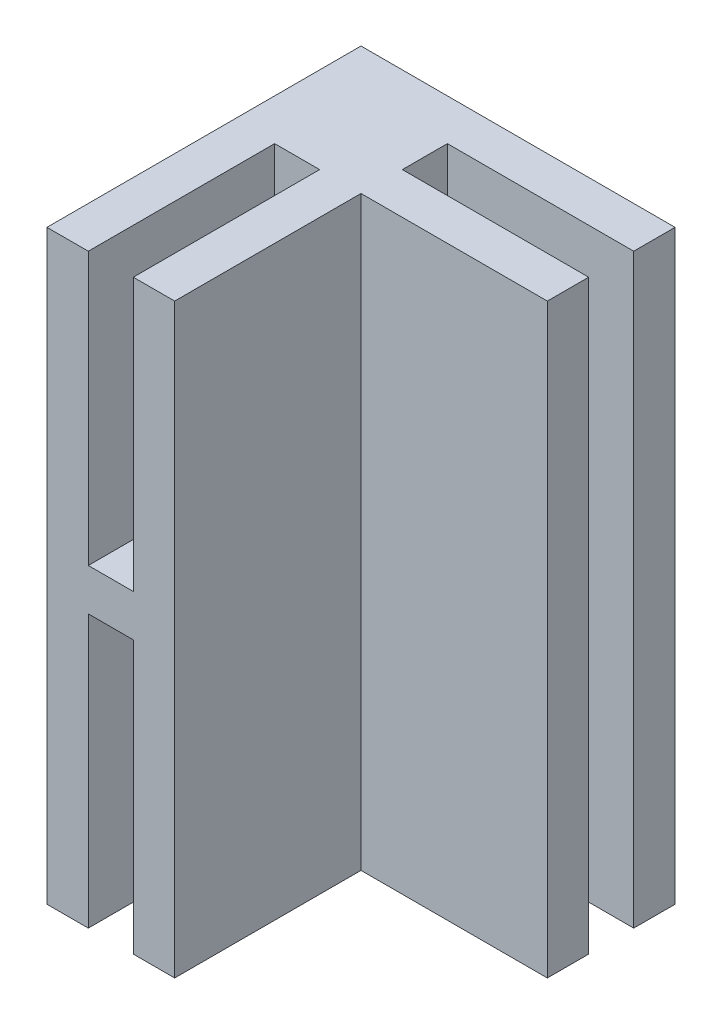
ISO-10303-21;
HEADER;
FILE_DESCRIPTION(('STEP AP214'),'2;1');
FILE_NAME('part.step','',(''),(''),'','','');
FILE_SCHEMA(('AUTOMOTIVE_DESIGN { 1 0 10303 214 1 1 1 1 }'));
ENDSEC;
DATA;
#1=APPLICATION_CONTEXT('core data for automotive mechanical design processes');
#2=APPLICATION_PROTOCOL_DEFINITION('international standard','automotive_design',2000,#1);
#3=PRODUCT_CONTEXT('',#1,'mechanical');
#4=PRODUCT('Part','Part','',(#3));
#5=PRODUCT_RELATED_PRODUCT_CATEGORY('part','',(#4));
#6=PRODUCT_DEFINITION_FORMATION('','',#4);
#7=PRODUCT_DEFINITION_CONTEXT('part definition',#1,'design');
#8=PRODUCT_DEFINITION('design','',#6,#7);
#9=PRODUCT_DEFINITION_SHAPE('','',#8);
#10=(LENGTH_UNIT() NAMED_UNIT(*) SI_UNIT(.MILLI.,.METRE.));
#11=(NAMED_UNIT(*) PLANE_ANGLE_UNIT() SI_UNIT($,.RADIAN.));
#12=(NAMED_UNIT(*) SI_UNIT($,.STERADIAN.) SOLID_ANGLE_UNIT());
#13=UNCERTAINTY_MEASURE_WITH_UNIT(LENGTH_MEASURE(1.E-05),#10,'distance_accuracy_value','');
#14=(GEOMETRIC_REPRESENTATION_CONTEXT(3) GLOBAL_UNCERTAINTY_ASSIGNED_CONTEXT((#13)) GLOBAL_UNIT_ASSIGNED_CONTEXT((#10,
#11,#12)) REPRESENTATION_CONTEXT('',''));
#15=CARTESIAN_POINT('',(0.,0.,0.));
#16=DIRECTION('',(0.,0.,1.));
#17=DIRECTION('',(1.,0.,0.));
#18=AXIS2_PLACEMENT_3D('',#15,#16,#17);
#19=CARTESIAN_POINT('',(18.6206896551724,56.,-9.38423645320196));
#20=DIRECTION('',(-1.,0.,0.));
#21=DIRECTION('',(0.,0.,1.));
#22=AXIS2_PLACEMENT_3D('',#19,#20,#21);
#23=PLANE('',#22);
#24=DIRECTION('',(0.,0.,-1.));
#25=VECTOR('',#24,1.);
#26=CARTESIAN_POINT('',(18.6206896551724,56.,-9.38423645320196));
#27=LINE('',#26,#25);
#28=CARTESIAN_POINT('',(18.6206896551724,56.,-5.43423645320196));
#29=VERTEX_POINT('',#28);
#30=CARTESIAN_POINT('',(18.6206896551724,56.,-9.38423645320196));
#31=VERTEX_POINT('',#30);
#32=EDGE_CURVE('E325',#29,#31,#27,.T.);
#33=ORIENTED_EDGE('',*,*,#32,.F.);
#34=DIRECTION('',(0.,-1.,0.));
#35=VECTOR('',#34,1.);
#36=CARTESIAN_POINT('',(18.6206896551724,56.,-5.43423645320196));
#37=LINE('',#36,#35);
#38=CARTESIAN_POINT('',(18.6206896551724,0.,-5.43423645320196));
#39=VERTEX_POINT('',#38);
#40=EDGE_CURVE('E279',#29,#39,#37,.T.);
#41=ORIENTED_EDGE('',*,*,#40,.T.);
#42=DIRECTION('',(0.,0.,-1.));
#43=VECTOR('',#42,1.);
#44=CARTESIAN_POINT('',(18.6206896551724,0.,-9.38423645320196));
#45=LINE('',#44,#43);
#46=CARTESIAN_POINT('',(18.6206896551724,0.,-9.38423645320196));
#47=VERTEX_POINT('',#46);
#48=EDGE_CURVE('E341',#39,#47,#45,.T.);
#49=ORIENTED_EDGE('',*,*,#48,.T.);
#50=DIRECTION('',(0.,-1.,0.));
#51=VECTOR('',#50,1.);
#52=CARTESIAN_POINT('',(18.6206896551724,56.,-9.38423645320196));
#53=LINE('',#52,#51);
#54=EDGE_CURVE('E48',#31,#47,#53,.T.);
#55=ORIENTED_EDGE('',*,*,#54,.F.);
#56=EDGE_LOOP('',(#33,#41,#49,#55));
#57=FACE_BOUND('',#56,.T.);
#58=ADVANCED_FACE('F39',(#57),#23,.F.);
#59=CARTESIAN_POINT('',(-11.3793103448276,56.,-9.38423645320196));
#60=DIRECTION('',(1.,0.,0.));
#61=DIRECTION('',(0.,0.,-1.));
#62=AXIS2_PLACEMENT_3D('',#59,#60,#61);
#63=PLANE('',#62);
#64=DIRECTION('',(0.,0.,1.));
#65=VECTOR('',#64,1.);
#66=CARTESIAN_POINT('',(-11.3793103448276,0.,-9.38423645320196));
#67=LINE('',#66,#65);
#68=CARTESIAN_POINT('',(-11.3793103448276,0.,-9.38423645320196));
#69=VERTEX_POINT('',#68);
#70=CARTESIAN_POINT('',(-11.3793103448276,0.,20.615763546798));
#71=VERTEX_POINT('',#70);
#72=EDGE_CURVE('E283',#69,#71,#67,.T.);
#73=ORIENTED_EDGE('',*,*,#72,.T.);
#74=DIRECTION('',(0.,-1.,0.));
#75=VECTOR('',#74,1.);
#76=CARTESIAN_POINT('',(-11.3793103448276,56.,20.615763546798));
#77=LINE('',#76,#75);
#78=CARTESIAN_POINT('',(-11.3793103448276,56.,20.615763546798));
#79=VERTEX_POINT('',#78);
#80=EDGE_CURVE('E11',#79,#71,#77,.T.);
#81=ORIENTED_EDGE('',*,*,#80,.F.);
#82=DIRECTION('',(0.,0.,1.));
#83=VECTOR('',#82,1.);
#84=CARTESIAN_POINT('',(-11.3793103448276,56.,-9.38423645320196));
#85=LINE('',#84,#83);
#86=CARTESIAN_POINT('',(-11.3793103448276,56.,-9.38423645320196));
#87=VERTEX_POINT('',#86);
#88=EDGE_CURVE('E316',#87,#79,#85,.T.);
#89=ORIENTED_EDGE('',*,*,#88,.F.);
#90=DIRECTION('',(0.,-1.,0.));
#91=VECTOR('',#90,1.);
#92=CARTESIAN_POINT('',(-11.3793103448276,56.,-9.38423645320196));
#93=LINE('',#92,#91);
#94=EDGE_CURVE('E332',#87,#69,#93,.T.);
#95=ORIENTED_EDGE('',*,*,#94,.T.);
#96=EDGE_LOOP('',(#73,#81,#89,#95));
#97=FACE_BOUND('',#96,.T.);
#98=ADVANCED_FACE('F41',(#97),#63,.F.);
#99=CARTESIAN_POINT('',(-11.3793103448276,56.,20.615763546798));
#100=DIRECTION('',(0.,0.,-1.));
#101=DIRECTION('',(-1.,0.,0.));
#102=AXIS2_PLACEMENT_3D('',#99,#100,#101);
#103=PLANE('',#102);
#104=DIRECTION('',(1.,0.,0.));
#105=VECTOR('',#104,1.);
#106=CARTESIAN_POINT('',(-7.42931034482758,30.,20.615763546798));
#107=LINE('',#106,#105);
#108=CARTESIAN_POINT('',(-7.42931034482758,30.,20.615763546798));
#109=VERTEX_POINT('',#108);
#110=CARTESIAN_POINT('',(-3.12931034482758,30.,20.615763546798));
#111=VERTEX_POINT('',#110);
#112=EDGE_CURVE('E184',#109,#111,#107,.T.);
#113=ORIENTED_EDGE('',*,*,#112,.F.);
#114=DIRECTION('',(0.,1.,0.));
#115=VECTOR('',#114,1.);
#116=CARTESIAN_POINT('',(-7.42931034482758,30.,20.615763546798));
#117=LINE('',#116,#115);
#118=CARTESIAN_POINT('',(-7.42931034482758,56.,20.615763546798));
#119=VERTEX_POINT('',#118);
#120=EDGE_CURVE('E167',#109,#119,#117,.T.);
#121=ORIENTED_EDGE('',*,*,#120,.T.);
#122=DIRECTION('',(1.,0.,0.));
#123=VECTOR('',#122,1.);
#124=CARTESIAN_POINT('',(-11.3793103448276,56.,20.615763546798));
#125=LINE('',#124,#123);
#126=EDGE_CURVE('E322',#79,#119,#125,.T.);
#127=ORIENTED_EDGE('',*,*,#126,.F.);
#128=ORIENTED_EDGE('',*,*,#80,.T.);
#129=DIRECTION('',(1.,0.,0.));
#130=VECTOR('',#129,1.);
#131=CARTESIAN_POINT('',(-11.3793103448276,0.,20.615763546798));
#132=LINE('',#131,#130);
#133=CARTESIAN_POINT('',(-7.42931034482758,0.,20.615763546798));
#134=VERTEX_POINT('',#133);
#135=EDGE_CURVE('E337',#71,#134,#132,.T.);
#136=ORIENTED_EDGE('',*,*,#135,.T.);
#137=DIRECTION('',(0.,-1.,0.));
#138=VECTOR('',#137,1.);
#139=CARTESIAN_POINT('',(-7.42931034482758,26.,20.615763546798));
#140=LINE('',#139,#138);
#141=CARTESIAN_POINT('',(-7.42931034482758,26.,20.615763546798));
#142=VERTEX_POINT('',#141);
#143=EDGE_CURVE('E63',#142,#134,#140,.T.);
#144=ORIENTED_EDGE('',*,*,#143,.F.);
#145=DIRECTION('',(-1.,0.,0.));
#146=VECTOR('',#145,1.);
#147=CARTESIAN_POINT('',(-3.12931034482758,26.,20.615763546798));
#148=LINE('',#147,#146);
#149=CARTESIAN_POINT('',(-3.12931034482758,26.,20.615763546798));
#150=VERTEX_POINT('',#149);
#151=EDGE_CURVE('E220',#150,#142,#148,.T.);
#152=ORIENTED_EDGE('',*,*,#151,.F.);
#153=DIRECTION('',(0.,-1.,0.));
#154=VECTOR('',#153,1.);
#155=CARTESIAN_POINT('',(-3.12931034482758,26.,20.615763546798));
#156=LINE('',#155,#154);
#157=CARTESIAN_POINT('',(-3.12931034482758,0.,20.615763546798));
#158=VERTEX_POINT('',#157);
#159=EDGE_CURVE('E233',#150,#158,#156,.T.);
#160=ORIENTED_EDGE('',*,*,#159,.T.);
#161=CARTESIAN_POINT('',(0.820689655172419,0.,20.615763546798));
#162=VERTEX_POINT('',#161);
#163=EDGE_CURVE('E336',#158,#162,#132,.T.);
#164=ORIENTED_EDGE('',*,*,#163,.T.);
#165=DIRECTION('',(0.,-1.,0.));
#166=VECTOR('',#165,1.);
#167=CARTESIAN_POINT('',(0.820689655172419,56.,20.615763546798));
#168=LINE('',#167,#166);
#169=CARTESIAN_POINT('',(0.820689655172419,56.,20.615763546798));
#170=VERTEX_POINT('',#169);
#171=EDGE_CURVE('E301',#170,#162,#168,.T.);
#172=ORIENTED_EDGE('',*,*,#171,.F.);
#173=CARTESIAN_POINT('',(-3.12931034482758,56.,20.615763546798));
#174=VERTEX_POINT('',#173);
#175=EDGE_CURVE('E320',#174,#170,#125,.T.);
#176=ORIENTED_EDGE('',*,*,#175,.F.);
#177=DIRECTION('',(0.,1.,0.));
#178=VECTOR('',#177,1.);
#179=CARTESIAN_POINT('',(-3.12931034482758,30.,20.615763546798));
#180=LINE('',#179,#178);
#181=EDGE_CURVE('E55',#111,#174,#180,.T.);
#182=ORIENTED_EDGE('',*,*,#181,.F.);
#183=EDGE_LOOP('',(#113,#121,#127,#128,#136,#144,#152,#160,#164,#172,#176,#182));
#184=FACE_BOUND('',#183,.T.);
#185=ADVANCED_FACE('F189',(#184),#103,.F.);
#186=CARTESIAN_POINT('',(18.6206896551724,0.,2.81576354679804));
#187=VERTEX_POINT('',#186);
#188=CARTESIAN_POINT('',(18.6206896551724,0.,-1.13423645320196));
#189=VERTEX_POINT('',#188);
#190=EDGE_CURVE('E344',#187,#189,#45,.T.);
#191=ORIENTED_EDGE('',*,*,#190,.T.);
#192=DIRECTION('',(0.,-1.,0.));
#193=VECTOR('',#192,1.);
#194=CARTESIAN_POINT('',(18.6206896551724,56.,-1.13423645320196));
#195=LINE('',#194,#193);
#196=CARTESIAN_POINT('',(18.6206896551724,56.,-1.13423645320196));
#197=VERTEX_POINT('',#196);
#198=EDGE_CURVE('E267',#197,#189,#195,.T.);
#199=ORIENTED_EDGE('',*,*,#198,.F.);
#200=CARTESIAN_POINT('',(18.6206896551724,56.,2.81576354679804));
#201=VERTEX_POINT('',#200);
#202=EDGE_CURVE('E328',#201,#197,#27,.T.);
#203=ORIENTED_EDGE('',*,*,#202,.F.);
#204=DIRECTION('',(0.,-1.,0.));
#205=VECTOR('',#204,1.);
#206=CARTESIAN_POINT('',(18.6206896551724,56.,2.81576354679804));
#207=LINE('',#206,#205);
#208=EDGE_CURVE('E273',#201,#187,#207,.T.);
#209=ORIENTED_EDGE('',*,*,#208,.T.);
#210=EDGE_LOOP('',(#191,#199,#203,#209));
#211=FACE_BOUND('',#210,.T.);
#212=ADVANCED_FACE('F386',(#211),#23,.F.);
#213=CARTESIAN_POINT('',(-11.3793103448276,56.,-9.38423645320196));
#214=DIRECTION('',(0.,0.,1.));
#215=DIRECTION('',(1.,0.,0.));
#216=AXIS2_PLACEMENT_3D('',#213,#214,#215);
#217=PLANE('',#216);
#218=DIRECTION('',(-1.,0.,0.));
#219=VECTOR('',#218,1.);
#220=CARTESIAN_POINT('',(-11.3793103448276,0.,-9.38423645320196));
#221=LINE('',#220,#219);
#222=EDGE_CURVE('E321',#47,#69,#221,.T.);
#223=ORIENTED_EDGE('',*,*,#222,.T.);
#224=ORIENTED_EDGE('',*,*,#94,.F.);
#225=DIRECTION('',(-1.,0.,0.));
#226=VECTOR('',#225,1.);
#227=CARTESIAN_POINT('',(-11.3793103448276,56.,-9.38423645320196));
#228=LINE('',#227,#226);
#229=EDGE_CURVE('E329',#31,#87,#228,.T.);
#230=ORIENTED_EDGE('',*,*,#229,.F.);
#231=ORIENTED_EDGE('',*,*,#54,.T.);
#232=EDGE_LOOP('',(#223,#224,#230,#231));
#233=FACE_BOUND('',#232,.T.);
#234=ADVANCED_FACE('F355',(#233),#217,.F.);
#235=CARTESIAN_POINT('',(0.,56.,0.));
#236=DIRECTION('',(0.,1.,0.));
#237=DIRECTION('',(0.,0.,1.));
#238=AXIS2_PLACEMENT_3D('',#235,#236,#237);
#239=PLANE('',#238);
#240=DIRECTION('',(0.,0.,1.));
#241=VECTOR('',#240,1.);
#242=CARTESIAN_POINT('',(-7.42931034482758,56.,20.615763546798));
#243=LINE('',#242,#241);
#244=CARTESIAN_POINT('',(-7.42931034482758,56.,2.81576354679803));
#245=VERTEX_POINT('',#244);
#246=EDGE_CURVE('E173',#245,#119,#243,.T.);
#247=ORIENTED_EDGE('',*,*,#246,.F.);
#248=DIRECTION('',(-1.,0.,0.));
#249=VECTOR('',#248,1.);
#250=CARTESIAN_POINT('',(-7.42931034482758,56.,2.81576354679803));
#251=LINE('',#250,#249);
#252=CARTESIAN_POINT('',(-3.12931034482758,56.,2.81576354679803));
#253=VERTEX_POINT('',#252);
#254=EDGE_CURVE('E187',#253,#245,#251,.T.);
#255=ORIENTED_EDGE('',*,*,#254,.F.);
#256=DIRECTION('',(0.,0.,-1.));
#257=VECTOR('',#256,1.);
#258=CARTESIAN_POINT('',(-3.12931034482758,56.,20.615763546798));
#259=LINE('',#258,#257);
#260=EDGE_CURVE('E201',#174,#253,#259,.T.);
#261=ORIENTED_EDGE('',*,*,#260,.F.);
#262=ORIENTED_EDGE('',*,*,#175,.T.);
#263=DIRECTION('',(0.,0.,-1.));
#264=VECTOR('',#263,1.);
#265=CARTESIAN_POINT('',(0.820689655172419,56.,20.615763546798));
#266=LINE('',#265,#264);
#267=CARTESIAN_POINT('',(0.820689655172419,56.,2.81576354679804));
#268=VERTEX_POINT('',#267);
#269=EDGE_CURVE('E292',#170,#268,#266,.T.);
#270=ORIENTED_EDGE('',*,*,#269,.T.);
#271=DIRECTION('',(1.,0.,0.));
#272=VECTOR('',#271,1.);
#273=CARTESIAN_POINT('',(18.6206896551724,56.,2.81576354679804));
#274=LINE('',#273,#272);
#275=EDGE_CURVE('E296',#268,#201,#274,.T.);
#276=ORIENTED_EDGE('',*,*,#275,.T.);
#277=ORIENTED_EDGE('',*,*,#202,.T.);
#278=DIRECTION('',(-1.,0.,0.));
#279=VECTOR('',#278,1.);
#280=CARTESIAN_POINT('',(18.6206896551724,56.,-1.13423645320196));
#281=LINE('',#280,#279);
#282=CARTESIAN_POINT('',(0.820689655172419,56.,-1.13423645320196));
#283=VERTEX_POINT('',#282);
#284=EDGE_CURVE('E254',#197,#283,#281,.T.);
#285=ORIENTED_EDGE('',*,*,#284,.T.);
#286=DIRECTION('',(0.,0.,-1.));
#287=VECTOR('',#286,1.);
#288=CARTESIAN_POINT('',(0.820689655172419,56.,-5.43423645320197));
#289=LINE('',#288,#287);
#290=CARTESIAN_POINT('',(0.820689655172419,56.,-5.43423645320197));
#291=VERTEX_POINT('',#290);
#292=EDGE_CURVE('E258',#283,#291,#289,.T.);
#293=ORIENTED_EDGE('',*,*,#292,.T.);
#294=DIRECTION('',(1.,0.,0.));
#295=VECTOR('',#294,1.);
#296=CARTESIAN_POINT('',(18.6206896551724,56.,-5.43423645320196));
#297=LINE('',#296,#295);
#298=EDGE_CURVE('E263',#291,#29,#297,.T.);
#299=ORIENTED_EDGE('',*,*,#298,.T.);
#300=ORIENTED_EDGE('',*,*,#32,.T.);
#301=ORIENTED_EDGE('',*,*,#229,.T.);
#302=ORIENTED_EDGE('',*,*,#88,.T.);
#303=ORIENTED_EDGE('',*,*,#126,.T.);
#304=EDGE_LOOP('',(#247,#255,#261,#262,#270,#276,#277,#285,#293,#299,#300,#301,#302,#303));
#305=FACE_BOUND('',#304,.T.);
#306=ADVANCED_FACE('F369',(#305),#239,.T.);
#307=CARTESIAN_POINT('',(0.,0.,0.));
#308=DIRECTION('',(0.,1.,0.));
#309=DIRECTION('',(0.,0.,1.));
#310=AXIS2_PLACEMENT_3D('',#307,#308,#309);
#311=PLANE('',#310);
#312=ORIENTED_EDGE('',*,*,#163,.F.);
#313=DIRECTION('',(0.,0.,1.));
#314=VECTOR('',#313,1.);
#315=CARTESIAN_POINT('',(-3.12931034482758,0.,20.615763546798));
#316=LINE('',#315,#314);
#317=CARTESIAN_POINT('',(-3.12931034482758,0.,2.81576354679803));
#318=VERTEX_POINT('',#317);
#319=EDGE_CURVE('E210',#318,#158,#316,.T.);
#320=ORIENTED_EDGE('',*,*,#319,.F.);
#321=DIRECTION('',(1.,0.,0.));
#322=VECTOR('',#321,1.);
#323=CARTESIAN_POINT('',(-3.12931034482758,0.,2.81576354679803));
#324=LINE('',#323,#322);
#325=CARTESIAN_POINT('',(-7.42931034482758,0.,2.81576354679803));
#326=VERTEX_POINT('',#325);
#327=EDGE_CURVE('E221',#326,#318,#324,.T.);
#328=ORIENTED_EDGE('',*,*,#327,.F.);
#329=DIRECTION('',(0.,0.,-1.));
#330=VECTOR('',#329,1.);
#331=CARTESIAN_POINT('',(-7.42931034482758,0.,20.615763546798));
#332=LINE('',#331,#330);
#333=EDGE_CURVE('E236',#134,#326,#332,.T.);
#334=ORIENTED_EDGE('',*,*,#333,.F.);
#335=ORIENTED_EDGE('',*,*,#135,.F.);
#336=ORIENTED_EDGE('',*,*,#72,.F.);
#337=ORIENTED_EDGE('',*,*,#222,.F.);
#338=ORIENTED_EDGE('',*,*,#48,.F.);
#339=DIRECTION('',(1.,0.,0.));
#340=VECTOR('',#339,1.);
#341=CARTESIAN_POINT('',(18.6206896551724,0.,-5.43423645320196));
#342=LINE('',#341,#340);
#343=CARTESIAN_POINT('',(0.820689655172419,0.,-5.43423645320197));
#344=VERTEX_POINT('',#343);
#345=EDGE_CURVE('E259',#344,#39,#342,.T.);
#346=ORIENTED_EDGE('',*,*,#345,.F.);
#347=DIRECTION('',(0.,0.,-1.));
#348=VECTOR('',#347,1.);
#349=CARTESIAN_POINT('',(0.820689655172419,0.,-5.43423645320197));
#350=LINE('',#349,#348);
#351=CARTESIAN_POINT('',(0.820689655172419,0.,-1.13423645320196));
#352=VERTEX_POINT('',#351);
#353=EDGE_CURVE('E272',#352,#344,#350,.T.);
#354=ORIENTED_EDGE('',*,*,#353,.F.);
#355=DIRECTION('',(-1.,0.,0.));
#356=VECTOR('',#355,1.);
#357=CARTESIAN_POINT('',(18.6206896551724,0.,-1.13423645320196));
#358=LINE('',#357,#356);
#359=EDGE_CURVE('E268',#189,#352,#358,.T.);
#360=ORIENTED_EDGE('',*,*,#359,.F.);
#361=ORIENTED_EDGE('',*,*,#190,.F.);
#362=DIRECTION('',(1.,0.,0.));
#363=VECTOR('',#362,1.);
#364=CARTESIAN_POINT('',(18.6206896551724,0.,2.81576354679804));
#365=LINE('',#364,#363);
#366=CARTESIAN_POINT('',(0.820689655172419,0.,2.81576354679804));
#367=VERTEX_POINT('',#366);
#368=EDGE_CURVE('E297',#367,#187,#365,.T.);
#369=ORIENTED_EDGE('',*,*,#368,.F.);
#370=DIRECTION('',(0.,0.,-1.));
#371=VECTOR('',#370,1.);
#372=CARTESIAN_POINT('',(0.820689655172419,0.,20.615763546798));
#373=LINE('',#372,#371);
#374=EDGE_CURVE('E245',#162,#367,#373,.T.);
#375=ORIENTED_EDGE('',*,*,#374,.F.);
#376=EDGE_LOOP('',(#312,#320,#328,#334,#335,#336,#337,#338,#346,#354,#360,#361,#369,#375));
#377=FACE_BOUND('',#376,.T.);
#378=ADVANCED_FACE('F363',(#377),#311,.F.);
#379=CARTESIAN_POINT('',(18.6206896551724,56.,2.81576354679804));
#380=DIRECTION('',(0.,0.,-1.));
#381=DIRECTION('',(-1.,0.,0.));
#382=AXIS2_PLACEMENT_3D('',#379,#380,#381);
#383=PLANE('',#382);
#384=ORIENTED_EDGE('',*,*,#368,.T.);
#385=ORIENTED_EDGE('',*,*,#208,.F.);
#386=ORIENTED_EDGE('',*,*,#275,.F.);
#387=DIRECTION('',(0.,-1.,0.));
#388=VECTOR('',#387,1.);
#389=CARTESIAN_POINT('',(0.820689655172419,56.,2.81576354679804));
#390=LINE('',#389,#388);
#391=EDGE_CURVE('E310',#268,#367,#390,.T.);
#392=ORIENTED_EDGE('',*,*,#391,.T.);
#393=EDGE_LOOP('',(#384,#385,#386,#392));
#394=FACE_BOUND('',#393,.T.);
#395=ADVANCED_FACE('F401',(#394),#383,.F.);
#396=CARTESIAN_POINT('',(0.820689655172419,56.,20.615763546798));
#397=DIRECTION('',(-1.,0.,0.));
#398=DIRECTION('',(0.,0.,1.));
#399=AXIS2_PLACEMENT_3D('',#396,#397,#398);
#400=PLANE('',#399);
#401=ORIENTED_EDGE('',*,*,#374,.T.);
#402=ORIENTED_EDGE('',*,*,#391,.F.);
#403=ORIENTED_EDGE('',*,*,#269,.F.);
#404=ORIENTED_EDGE('',*,*,#171,.T.);
#405=EDGE_LOOP('',(#401,#402,#403,#404));
#406=FACE_BOUND('',#405,.T.);
#407=ADVANCED_FACE('F398',(#406),#400,.F.);
#408=CARTESIAN_POINT('',(18.6206896551724,56.,-5.43423645320196));
#409=DIRECTION('',(0.,0.,-1.));
#410=DIRECTION('',(-1.,0.,0.));
#411=AXIS2_PLACEMENT_3D('',#408,#409,#410);
#412=PLANE('',#411);
#413=ORIENTED_EDGE('',*,*,#345,.T.);
#414=ORIENTED_EDGE('',*,*,#40,.F.);
#415=ORIENTED_EDGE('',*,*,#298,.F.);
#416=DIRECTION('',(0.,-1.,0.));
#417=VECTOR('',#416,1.);
#418=CARTESIAN_POINT('',(0.820689655172419,56.,-5.43423645320197));
#419=LINE('',#418,#417);
#420=EDGE_CURVE('E284',#291,#344,#419,.T.);
#421=ORIENTED_EDGE('',*,*,#420,.T.);
#422=EDGE_LOOP('',(#413,#414,#415,#421));
#423=FACE_BOUND('',#422,.T.);
#424=ADVANCED_FACE('F372',(#423),#412,.F.);
#425=CARTESIAN_POINT('',(0.820689655172419,56.,-5.43423645320197));
#426=DIRECTION('',(-1.,0.,0.));
#427=DIRECTION('',(0.,0.,1.));
#428=AXIS2_PLACEMENT_3D('',#425,#426,#427);
#429=PLANE('',#428);
#430=ORIENTED_EDGE('',*,*,#353,.T.);
#431=ORIENTED_EDGE('',*,*,#420,.F.);
#432=ORIENTED_EDGE('',*,*,#292,.F.);
#433=DIRECTION('',(0.,-1.,0.));
#434=VECTOR('',#433,1.);
#435=CARTESIAN_POINT('',(0.820689655172419,56.,-1.13423645320196));
#436=LINE('',#435,#434);
#437=EDGE_CURVE('E287',#283,#352,#436,.T.);
#438=ORIENTED_EDGE('',*,*,#437,.T.);
#439=EDGE_LOOP('',(#430,#431,#432,#438));
#440=FACE_BOUND('',#439,.T.);
#441=ADVANCED_FACE('F378',(#440),#429,.F.);
#442=CARTESIAN_POINT('',(18.6206896551724,56.,-1.13423645320196));
#443=DIRECTION('',(0.,0.,1.));
#444=DIRECTION('',(1.,0.,0.));
#445=AXIS2_PLACEMENT_3D('',#442,#443,#444);
#446=PLANE('',#445);
#447=ORIENTED_EDGE('',*,*,#359,.T.);
#448=ORIENTED_EDGE('',*,*,#437,.F.);
#449=ORIENTED_EDGE('',*,*,#284,.F.);
#450=ORIENTED_EDGE('',*,*,#198,.T.);
#451=EDGE_LOOP('',(#447,#448,#449,#450));
#452=FACE_BOUND('',#451,.T.);
#453=ADVANCED_FACE('F381',(#452),#446,.F.);
#454=CARTESIAN_POINT('',(-3.12931034482758,26.,20.615763546798));
#455=DIRECTION('',(1.,0.,0.));
#456=DIRECTION('',(0.,0.,-1.));
#457=AXIS2_PLACEMENT_3D('',#454,#455,#456);
#458=PLANE('',#457);
#459=ORIENTED_EDGE('',*,*,#319,.T.);
#460=ORIENTED_EDGE('',*,*,#159,.F.);
#461=DIRECTION('',(0.,0.,1.));
#462=VECTOR('',#461,1.);
#463=CARTESIAN_POINT('',(-3.12931034482758,26.,20.615763546798));
#464=LINE('',#463,#462);
#465=CARTESIAN_POINT('',(-3.12931034482758,26.,2.81576354679803));
#466=VERTEX_POINT('',#465);
#467=EDGE_CURVE('E216',#466,#150,#464,.T.);
#468=ORIENTED_EDGE('',*,*,#467,.F.);
#469=DIRECTION('',(0.,-1.,0.));
#470=VECTOR('',#469,1.);
#471=CARTESIAN_POINT('',(-3.12931034482758,26.,2.81576354679803));
#472=LINE('',#471,#470);
#473=EDGE_CURVE('E242',#466,#318,#472,.T.);
#474=ORIENTED_EDGE('',*,*,#473,.T.);
#475=EDGE_LOOP('',(#459,#460,#468,#474));
#476=FACE_BOUND('',#475,.T.);
#477=ADVANCED_FACE('F494',(#476),#458,.F.);
#478=CARTESIAN_POINT('',(-3.12931034482758,26.,2.81576354679803));
#479=DIRECTION('',(0.,0.,-1.));
#480=DIRECTION('',(-1.,0.,0.));
#481=AXIS2_PLACEMENT_3D('',#478,#479,#480);
#482=PLANE('',#481);
#483=ORIENTED_EDGE('',*,*,#327,.T.);
#484=ORIENTED_EDGE('',*,*,#473,.F.);
#485=DIRECTION('',(1.,0.,0.));
#486=VECTOR('',#485,1.);
#487=CARTESIAN_POINT('',(-3.12931034482758,26.,2.81576354679803));
#488=LINE('',#487,#486);
#489=CARTESIAN_POINT('',(-7.42931034482758,26.,2.81576354679803));
#490=VERTEX_POINT('',#489);
#491=EDGE_CURVE('E229',#490,#466,#488,.T.);
#492=ORIENTED_EDGE('',*,*,#491,.F.);
#493=DIRECTION('',(0.,-1.,0.));
#494=VECTOR('',#493,1.);
#495=CARTESIAN_POINT('',(-7.42931034482758,26.,2.81576354679803));
#496=LINE('',#495,#494);
#497=EDGE_CURVE('E246',#490,#326,#496,.T.);
#498=ORIENTED_EDGE('',*,*,#497,.T.);
#499=EDGE_LOOP('',(#483,#484,#492,#498));
#500=FACE_BOUND('',#499,.T.);
#501=ADVANCED_FACE('F509',(#500),#482,.F.);
#502=CARTESIAN_POINT('',(-7.42931034482758,26.,20.615763546798));
#503=DIRECTION('',(-1.,0.,0.));
#504=DIRECTION('',(0.,0.,1.));
#505=AXIS2_PLACEMENT_3D('',#502,#503,#504);
#506=PLANE('',#505);
#507=ORIENTED_EDGE('',*,*,#333,.T.);
#508=ORIENTED_EDGE('',*,*,#497,.F.);
#509=DIRECTION('',(0.,0.,-1.));
#510=VECTOR('',#509,1.);
#511=CARTESIAN_POINT('',(-7.42931034482758,26.,20.615763546798));
#512=LINE('',#511,#510);
#513=EDGE_CURVE('E225',#142,#490,#512,.T.);
#514=ORIENTED_EDGE('',*,*,#513,.F.);
#515=ORIENTED_EDGE('',*,*,#143,.T.);
#516=EDGE_LOOP('',(#507,#508,#514,#515));
#517=FACE_BOUND('',#516,.T.);
#518=ADVANCED_FACE('F519',(#517),#506,.F.);
#519=CARTESIAN_POINT('',(0.,26.,0.));
#520=DIRECTION('',(0.,1.,0.));
#521=DIRECTION('',(0.,0.,1.));
#522=AXIS2_PLACEMENT_3D('',#519,#520,#521);
#523=PLANE('',#522);
#524=ORIENTED_EDGE('',*,*,#467,.T.);
#525=ORIENTED_EDGE('',*,*,#151,.T.);
#526=ORIENTED_EDGE('',*,*,#513,.T.);
#527=ORIENTED_EDGE('',*,*,#491,.T.);
#528=EDGE_LOOP('',(#524,#525,#526,#527));
#529=FACE_BOUND('',#528,.T.);
#530=ADVANCED_FACE('F413',(#529),#523,.F.);
#531=CARTESIAN_POINT('',(-7.42931034482758,30.,20.615763546798));
#532=DIRECTION('',(-1.,0.,0.));
#533=DIRECTION('',(0.,0.,1.));
#534=AXIS2_PLACEMENT_3D('',#531,#532,#533);
#535=PLANE('',#534);
#536=ORIENTED_EDGE('',*,*,#246,.T.);
#537=ORIENTED_EDGE('',*,*,#120,.F.);
#538=DIRECTION('',(0.,0.,1.));
#539=VECTOR('',#538,1.);
#540=CARTESIAN_POINT('',(-7.42931034482758,30.,20.615763546798));
#541=LINE('',#540,#539);
#542=CARTESIAN_POINT('',(-7.42931034482758,30.,2.81576354679803));
#543=VERTEX_POINT('',#542);
#544=EDGE_CURVE('E170',#543,#109,#541,.T.);
#545=ORIENTED_EDGE('',*,*,#544,.F.);
#546=DIRECTION('',(0.,1.,0.));
#547=VECTOR('',#546,1.);
#548=CARTESIAN_POINT('',(-7.42931034482758,30.,2.81576354679803));
#549=LINE('',#548,#547);
#550=EDGE_CURVE('E207',#543,#245,#549,.T.);
#551=ORIENTED_EDGE('',*,*,#550,.T.);
#552=EDGE_LOOP('',(#536,#537,#545,#551));
#553=FACE_BOUND('',#552,.T.);
#554=ADVANCED_FACE('F169',(#553),#535,.F.);
#555=CARTESIAN_POINT('',(-7.42931034482758,30.,2.81576354679803));
#556=DIRECTION('',(0.,0.,-1.));
#557=DIRECTION('',(-1.,0.,0.));
#558=AXIS2_PLACEMENT_3D('',#555,#556,#557);
#559=PLANE('',#558);
#560=ORIENTED_EDGE('',*,*,#254,.T.);
#561=ORIENTED_EDGE('',*,*,#550,.F.);
#562=DIRECTION('',(-1.,0.,0.));
#563=VECTOR('',#562,1.);
#564=CARTESIAN_POINT('',(-7.42931034482758,30.,2.81576354679803));
#565=LINE('',#564,#563);
#566=CARTESIAN_POINT('',(-3.12931034482758,30.,2.81576354679803));
#567=VERTEX_POINT('',#566);
#568=EDGE_CURVE('E178',#567,#543,#565,.T.);
#569=ORIENTED_EDGE('',*,*,#568,.F.);
#570=DIRECTION('',(0.,1.,0.));
#571=VECTOR('',#570,1.);
#572=CARTESIAN_POINT('',(-3.12931034482758,30.,2.81576354679803));
#573=LINE('',#572,#571);
#574=EDGE_CURVE('E211',#567,#253,#573,.T.);
#575=ORIENTED_EDGE('',*,*,#574,.T.);
#576=EDGE_LOOP('',(#560,#561,#569,#575));
#577=FACE_BOUND('',#576,.T.);
#578=ADVANCED_FACE('F405',(#577),#559,.F.);
#579=CARTESIAN_POINT('',(-3.12931034482758,30.,20.615763546798));
#580=DIRECTION('',(1.,0.,0.));
#581=DIRECTION('',(0.,0.,-1.));
#582=AXIS2_PLACEMENT_3D('',#579,#580,#581);
#583=PLANE('',#582);
#584=ORIENTED_EDGE('',*,*,#260,.T.);
#585=ORIENTED_EDGE('',*,*,#574,.F.);
#586=DIRECTION('',(0.,0.,-1.));
#587=VECTOR('',#586,1.);
#588=CARTESIAN_POINT('',(-3.12931034482758,30.,20.615763546798));
#589=LINE('',#588,#587);
#590=EDGE_CURVE('E192',#111,#567,#589,.T.);
#591=ORIENTED_EDGE('',*,*,#590,.F.);
#592=ORIENTED_EDGE('',*,*,#181,.T.);
#593=EDGE_LOOP('',(#584,#585,#591,#592));
#594=FACE_BOUND('',#593,.T.);
#595=ADVANCED_FACE('F403',(#594),#583,.F.);
#596=CARTESIAN_POINT('',(0.,30.,0.));
#597=DIRECTION('',(0.,-1.,0.));
#598=DIRECTION('',(0.,0.,-1.));
#599=AXIS2_PLACEMENT_3D('',#596,#597,#598);
#600=PLANE('',#599);
#601=ORIENTED_EDGE('',*,*,#544,.T.);
#602=ORIENTED_EDGE('',*,*,#112,.T.);
#603=ORIENTED_EDGE('',*,*,#590,.T.);
#604=ORIENTED_EDGE('',*,*,#568,.T.);
#605=EDGE_LOOP('',(#601,#602,#603,#604));
#606=FACE_BOUND('',#605,.T.);
#607=ADVANCED_FACE('F182',(#606),#600,.F.);
#608=CLOSED_SHELL('',(#58,#98,#185,#212,#234,#306,#378,#395,#407,#424,#441,#453,#477,#501,#518,
#530,#554,#578,#595,#607));
#609=MANIFOLD_SOLID_BREP('B2',#608);
#610=ADVANCED_BREP_SHAPE_REPRESENTATION('',(#18,#609),#14);
#611=SHAPE_DEFINITION_REPRESENTATION(#9,#610);
ENDSEC;
END-ISO-10303-21;
